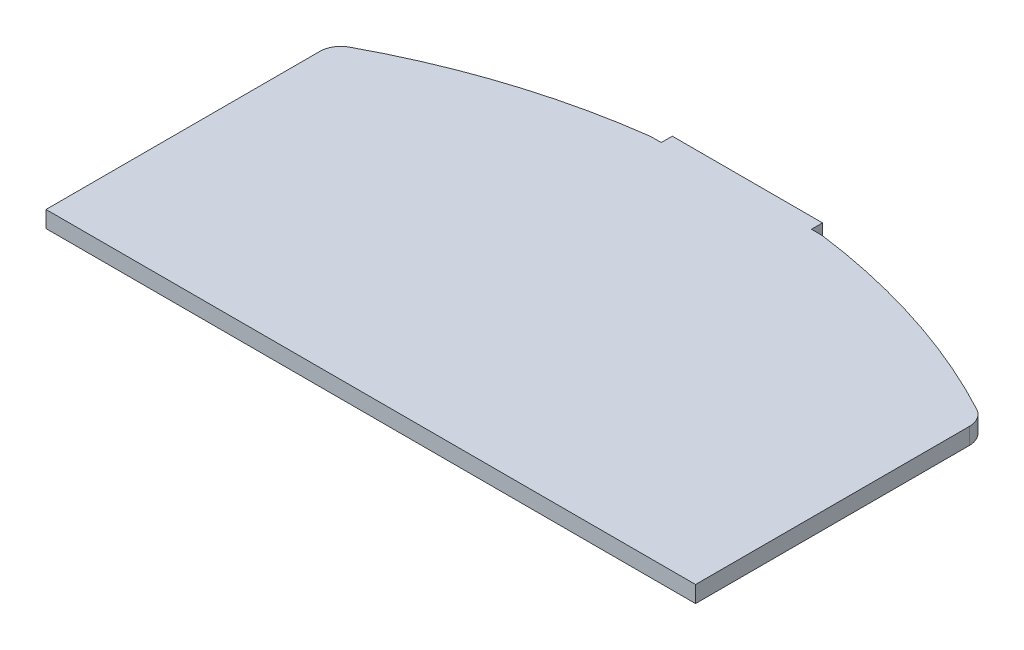
ISO-10303-21;
HEADER;
FILE_DESCRIPTION(('STEP AP214'),'2;1');
FILE_NAME('part.step','',(''),(''),'','','');
FILE_SCHEMA(('AUTOMOTIVE_DESIGN { 1 0 10303 214 1 1 1 1 }'));
ENDSEC;
DATA;
#1=APPLICATION_CONTEXT('core data for automotive mechanical design processes');
#2=APPLICATION_PROTOCOL_DEFINITION('international standard','automotive_design',2000,#1);
#3=PRODUCT_CONTEXT('',#1,'mechanical');
#4=PRODUCT('Part','Part','',(#3));
#5=PRODUCT_RELATED_PRODUCT_CATEGORY('part','',(#4));
#6=PRODUCT_DEFINITION_FORMATION('','',#4);
#7=PRODUCT_DEFINITION_CONTEXT('part definition',#1,'design');
#8=PRODUCT_DEFINITION('design','',#6,#7);
#9=PRODUCT_DEFINITION_SHAPE('','',#8);
#10=(LENGTH_UNIT() NAMED_UNIT(*) SI_UNIT(.MILLI.,.METRE.));
#11=(NAMED_UNIT(*) PLANE_ANGLE_UNIT() SI_UNIT($,.RADIAN.));
#12=(NAMED_UNIT(*) SI_UNIT($,.STERADIAN.) SOLID_ANGLE_UNIT());
#13=UNCERTAINTY_MEASURE_WITH_UNIT(LENGTH_MEASURE(1.E-05),#10,'distance_accuracy_value','');
#14=(GEOMETRIC_REPRESENTATION_CONTEXT(3) GLOBAL_UNCERTAINTY_ASSIGNED_CONTEXT((#13)) GLOBAL_UNIT_ASSIGNED_CONTEXT((#10,
#11,#12)) REPRESENTATION_CONTEXT('',''));
#15=CARTESIAN_POINT('',(0.,0.,0.));
#16=DIRECTION('',(0.,0.,1.));
#17=DIRECTION('',(1.,0.,0.));
#18=AXIS2_PLACEMENT_3D('',#15,#16,#17);
#19=CARTESIAN_POINT('',(29.3999563827221,1.5,35.6940425271087));
#20=DIRECTION('',(0.,0.,-1.));
#21=DIRECTION('',(-1.,0.,0.));
#22=AXIS2_PLACEMENT_3D('',#19,#20,#21);
#23=PLANE('',#22);
#24=DIRECTION('',(1.,0.,0.));
#25=VECTOR('',#24,1.);
#26=CARTESIAN_POINT('',(29.3999563827221,0.,35.6940425271087));
#27=LINE('',#26,#25);
#28=CARTESIAN_POINT('',(-29.3999563827227,0.,35.6940425271087));
#29=VERTEX_POINT('',#28);
#30=CARTESIAN_POINT('',(29.3999563827221,0.,35.6940425271087));
#31=VERTEX_POINT('',#30);
#32=EDGE_CURVE('E173',#29,#31,#27,.T.);
#33=ORIENTED_EDGE('',*,*,#32,.T.);
#34=DIRECTION('',(0.,-1.,0.));
#35=VECTOR('',#34,1.);
#36=CARTESIAN_POINT('',(29.3999563827221,1.5,35.6940425271087));
#37=LINE('',#36,#35);
#38=CARTESIAN_POINT('',(29.3999563827221,1.5,35.6940425271087));
#39=VERTEX_POINT('',#38);
#40=EDGE_CURVE('E11',#39,#31,#37,.T.);
#41=ORIENTED_EDGE('',*,*,#40,.F.);
#42=DIRECTION('',(1.,0.,0.));
#43=VECTOR('',#42,1.);
#44=CARTESIAN_POINT('',(29.3999563827221,1.5,35.6940425271087));
#45=LINE('',#44,#43);
#46=CARTESIAN_POINT('',(-29.3999563827227,1.5,35.6940425271087));
#47=VERTEX_POINT('',#46);
#48=EDGE_CURVE('E199',#47,#39,#45,.T.);
#49=ORIENTED_EDGE('',*,*,#48,.F.);
#50=DIRECTION('',(0.,-1.,0.));
#51=VECTOR('',#50,1.);
#52=CARTESIAN_POINT('',(-29.3999563827227,1.5,35.6940425271087));
#53=LINE('',#52,#51);
#54=EDGE_CURVE('E169',#47,#29,#53,.T.);
#55=ORIENTED_EDGE('',*,*,#54,.T.);
#56=EDGE_LOOP('',(#33,#41,#49,#55));
#57=FACE_BOUND('',#56,.T.);
#58=ADVANCED_FACE('F41',(#57),#23,.F.);
#59=CARTESIAN_POINT('',(29.3999563827221,1.5,10.9094402260191));
#60=DIRECTION('',(-1.,0.,0.));
#61=DIRECTION('',(0.,0.,1.));
#62=AXIS2_PLACEMENT_3D('',#59,#60,#61);
#63=PLANE('',#62);
#64=DIRECTION('',(0.,0.,-1.));
#65=VECTOR('',#64,1.);
#66=CARTESIAN_POINT('',(29.3999563827221,0.,10.9094402260191));
#67=LINE('',#66,#65);
#68=CARTESIAN_POINT('',(29.3999563827221,0.,10.9094402260191));
#69=VERTEX_POINT('',#68);
#70=EDGE_CURVE('E176',#31,#69,#67,.T.);
#71=ORIENTED_EDGE('',*,*,#70,.T.);
#72=DIRECTION('',(0.,-1.,0.));
#73=VECTOR('',#72,1.);
#74=CARTESIAN_POINT('',(29.3999563827221,1.5,10.9094402260191));
#75=LINE('',#74,#73);
#76=CARTESIAN_POINT('',(29.3999563827221,1.5,10.9094402260191));
#77=VERTEX_POINT('',#76);
#78=EDGE_CURVE('E49',#77,#69,#75,.T.);
#79=ORIENTED_EDGE('',*,*,#78,.F.);
#80=DIRECTION('',(0.,0.,-1.));
#81=VECTOR('',#80,1.);
#82=CARTESIAN_POINT('',(29.3999563827221,1.5,10.9094402260191));
#83=LINE('',#82,#81);
#84=EDGE_CURVE('E118',#39,#77,#83,.T.);
#85=ORIENTED_EDGE('',*,*,#84,.F.);
#86=ORIENTED_EDGE('',*,*,#40,.T.);
#87=EDGE_LOOP('',(#71,#79,#85,#86));
#88=FACE_BOUND('',#87,.T.);
#89=ADVANCED_FACE('F287',(#88),#63,.F.);
#90=CARTESIAN_POINT('',(27.4999563827228,1.5,10.9094402260147));
#91=DIRECTION('',(0.,-1.,0.));
#92=DIRECTION('',(0.,0.,-1.));
#93=AXIS2_PLACEMENT_3D('',#90,#91,#92);
#94=CYLINDRICAL_SURFACE('',#93,1.89999999999968);
#95=CARTESIAN_POINT('',(27.4999563827228,0.,10.9094402260147));
#96=DIRECTION('',(0.,1.,0.));
#97=DIRECTION('',(0.,0.,-1.));
#98=AXIS2_PLACEMENT_3D('',#95,#96,#97);
#99=CIRCLE('',#98,1.89999999999968);
#100=CARTESIAN_POINT('',(28.3980237538553,0.,9.23508214098456));
#101=VERTEX_POINT('',#100);
#102=EDGE_CURVE('E178',#69,#101,#99,.T.);
#103=ORIENTED_EDGE('',*,*,#102,.T.);
#104=DIRECTION('',(0.,-1.,0.));
#105=VECTOR('',#104,1.);
#106=CARTESIAN_POINT('',(28.3980237538553,1.5,9.23508214098456));
#107=LINE('',#106,#105);
#108=CARTESIAN_POINT('',(28.3980237538553,1.5,9.23508214098456));
#109=VERTEX_POINT('',#108);
#110=EDGE_CURVE('E224',#109,#101,#107,.T.);
#111=ORIENTED_EDGE('',*,*,#110,.F.);
#112=CARTESIAN_POINT('',(27.4999563827228,1.5,10.9094402260147));
#113=DIRECTION('',(0.,1.,0.));
#114=DIRECTION('',(0.,0.,-1.));
#115=AXIS2_PLACEMENT_3D('',#112,#113,#114);
#116=CIRCLE('',#115,1.89999999999968);
#117=EDGE_CURVE('E232',#77,#109,#116,.T.);
#118=ORIENTED_EDGE('',*,*,#117,.F.);
#119=ORIENTED_EDGE('',*,*,#78,.T.);
#120=EDGE_LOOP('',(#103,#111,#118,#119));
#121=FACE_BOUND('',#120,.T.);
#122=ADVANCED_FACE('F230',(#121),#94,.T.);
#123=CARTESIAN_POINT('',(0.,1.5,62.1803980488232));
#124=DIRECTION('',(0.,-1.,0.));
#125=DIRECTION('',(0.,0.,-1.));
#126=AXIS2_PLACEMENT_3D('',#123,#124,#125);
#127=CYLINDRICAL_SURFACE('',#126,60.0803980488251);
#128=CARTESIAN_POINT('',(0.,0.,62.1803980488232));
#129=DIRECTION('',(0.,1.,0.));
#130=DIRECTION('',(0.,0.,-1.));
#131=AXIS2_PLACEMENT_3D('',#128,#129,#130);
#132=CIRCLE('',#131,60.0803980488251);
#133=CARTESIAN_POINT('',(7.85976152908615,0.,2.61632852355344));
#134=VERTEX_POINT('',#133);
#135=EDGE_CURVE('E180',#101,#134,#132,.T.);
#136=ORIENTED_EDGE('',*,*,#135,.T.);
#137=DIRECTION('',(0.,-1.,0.));
#138=VECTOR('',#137,1.);
#139=CARTESIAN_POINT('',(7.85976152908615,1.5,2.61632852355344));
#140=LINE('',#139,#138);
#141=CARTESIAN_POINT('',(7.85976152908615,1.5,2.61632852355344));
#142=VERTEX_POINT('',#141);
#143=EDGE_CURVE('E221',#142,#134,#140,.T.);
#144=ORIENTED_EDGE('',*,*,#143,.F.);
#145=CARTESIAN_POINT('',(0.,1.5,62.1803980488232));
#146=DIRECTION('',(0.,1.,0.));
#147=DIRECTION('',(0.,0.,-1.));
#148=AXIS2_PLACEMENT_3D('',#145,#146,#147);
#149=CIRCLE('',#148,60.0803980488251);
#150=EDGE_CURVE('E250',#109,#142,#149,.T.);
#151=ORIENTED_EDGE('',*,*,#150,.F.);
#152=ORIENTED_EDGE('',*,*,#110,.T.);
#153=EDGE_LOOP('',(#136,#144,#151,#152));
#154=FACE_BOUND('',#153,.T.);
#155=ADVANCED_FACE('F241',(#154),#127,.T.);
#156=CARTESIAN_POINT('',(7.61120214216065,1.5,4.49999999999922));
#157=DIRECTION('',(0.,-1.,0.));
#158=DIRECTION('',(0.,0.,-1.));
#159=AXIS2_PLACEMENT_3D('',#156,#157,#158);
#160=CYLINDRICAL_SURFACE('',#159,1.9);
#161=CARTESIAN_POINT('',(7.61120214216065,0.,4.49999999999922));
#162=DIRECTION('',(0.,1.,0.));
#163=DIRECTION('',(0.,0.,-1.));
#164=AXIS2_PLACEMENT_3D('',#161,#162,#163);
#165=CIRCLE('',#164,1.9);
#166=CARTESIAN_POINT('',(7.61120214218058,0.,2.59999999999922));
#167=VERTEX_POINT('',#166);
#168=EDGE_CURVE('E182',#134,#167,#165,.T.);
#169=ORIENTED_EDGE('',*,*,#168,.T.);
#170=DIRECTION('',(0.,-1.,0.));
#171=VECTOR('',#170,1.);
#172=CARTESIAN_POINT('',(7.61120214218058,1.5,2.59999999999922));
#173=LINE('',#172,#171);
#174=CARTESIAN_POINT('',(7.61120214218058,1.5,2.59999999999922));
#175=VERTEX_POINT('',#174);
#176=EDGE_CURVE('E218',#175,#167,#173,.T.);
#177=ORIENTED_EDGE('',*,*,#176,.F.);
#178=CARTESIAN_POINT('',(7.61120214216065,1.5,4.49999999999922));
#179=DIRECTION('',(0.,1.,0.));
#180=DIRECTION('',(0.,0.,-1.));
#181=AXIS2_PLACEMENT_3D('',#178,#179,#180);
#182=CIRCLE('',#181,1.9);
#183=EDGE_CURVE('E247',#142,#175,#182,.T.);
#184=ORIENTED_EDGE('',*,*,#183,.F.);
#185=ORIENTED_EDGE('',*,*,#143,.T.);
#186=EDGE_LOOP('',(#169,#177,#184,#185));
#187=FACE_BOUND('',#186,.T.);
#188=ADVANCED_FACE('F245',(#187),#160,.T.);
#189=CARTESIAN_POINT('',(7.61120214218058,1.5,2.59999999999922));
#190=DIRECTION('',(-1.3878606544089E-12,0.,1.));
#191=DIRECTION('',(1.,0.,1.3878606544089E-12));
#192=AXIS2_PLACEMENT_3D('',#189,#190,#191);
#193=PLANE('',#192);
#194=DIRECTION('',(-1.,0.,-1.3878606544089E-12));
#195=VECTOR('',#194,1.);
#196=CARTESIAN_POINT('',(7.61120214218058,0.,2.59999999999922));
#197=LINE('',#196,#195);
#198=CARTESIAN_POINT('',(6.79999999999689,0.,2.5999999999981));
#199=VERTEX_POINT('',#198);
#200=EDGE_CURVE('E184',#167,#199,#197,.T.);
#201=ORIENTED_EDGE('',*,*,#200,.T.);
#202=DIRECTION('',(0.,-1.,0.));
#203=VECTOR('',#202,1.);
#204=CARTESIAN_POINT('',(6.79999999999689,1.5,2.5999999999981));
#205=LINE('',#204,#203);
#206=CARTESIAN_POINT('',(6.79999999999689,1.5,2.5999999999981));
#207=VERTEX_POINT('',#206);
#208=EDGE_CURVE('E215',#207,#199,#205,.T.);
#209=ORIENTED_EDGE('',*,*,#208,.F.);
#210=DIRECTION('',(-1.,0.,-1.3878606544089E-12));
#211=VECTOR('',#210,1.);
#212=CARTESIAN_POINT('',(7.61120214218058,1.5,2.59999999999922));
#213=LINE('',#212,#211);
#214=EDGE_CURVE('E249',#175,#207,#213,.T.);
#215=ORIENTED_EDGE('',*,*,#214,.F.);
#216=ORIENTED_EDGE('',*,*,#176,.T.);
#217=EDGE_LOOP('',(#201,#209,#215,#216));
#218=FACE_BOUND('',#217,.T.);
#219=ADVANCED_FACE('F300',(#218),#193,.F.);
#220=CARTESIAN_POINT('',(6.79999999999689,1.5,1.59999999999809));
#221=DIRECTION('',(-1.,0.,0.));
#222=DIRECTION('',(0.,0.,1.));
#223=AXIS2_PLACEMENT_3D('',#220,#221,#222);
#224=PLANE('',#223);
#225=DIRECTION('',(0.,0.,-1.));
#226=VECTOR('',#225,1.);
#227=CARTESIAN_POINT('',(6.79999999999689,0.,1.59999999999809));
#228=LINE('',#227,#226);
#229=CARTESIAN_POINT('',(6.79999999999689,0.,1.59999999999809));
#230=VERTEX_POINT('',#229);
#231=EDGE_CURVE('E186',#199,#230,#228,.T.);
#232=ORIENTED_EDGE('',*,*,#231,.T.);
#233=DIRECTION('',(0.,-1.,0.));
#234=VECTOR('',#233,1.);
#235=CARTESIAN_POINT('',(6.79999999999689,1.5,1.59999999999809));
#236=LINE('',#235,#234);
#237=CARTESIAN_POINT('',(6.79999999999689,1.5,1.59999999999809));
#238=VERTEX_POINT('',#237);
#239=EDGE_CURVE('E212',#238,#230,#236,.T.);
#240=ORIENTED_EDGE('',*,*,#239,.F.);
#241=DIRECTION('',(0.,0.,-1.));
#242=VECTOR('',#241,1.);
#243=CARTESIAN_POINT('',(6.79999999999689,1.5,1.59999999999809));
#244=LINE('',#243,#242);
#245=EDGE_CURVE('E252',#207,#238,#244,.T.);
#246=ORIENTED_EDGE('',*,*,#245,.F.);
#247=ORIENTED_EDGE('',*,*,#208,.T.);
#248=EDGE_LOOP('',(#232,#240,#246,#247));
#249=FACE_BOUND('',#248,.T.);
#250=ADVANCED_FACE('F303',(#249),#224,.F.);
#251=CARTESIAN_POINT('',(-6.79999999999689,1.5,1.59999999999809));
#252=DIRECTION('',(0.,0.,1.));
#253=DIRECTION('',(1.,0.,0.));
#254=AXIS2_PLACEMENT_3D('',#251,#252,#253);
#255=PLANE('',#254);
#256=DIRECTION('',(-1.,0.,0.));
#257=VECTOR('',#256,1.);
#258=CARTESIAN_POINT('',(-6.79999999999689,0.,1.59999999999809));
#259=LINE('',#258,#257);
#260=CARTESIAN_POINT('',(-6.79999999999689,0.,1.59999999999809));
#261=VERTEX_POINT('',#260);
#262=EDGE_CURVE('E188',#230,#261,#259,.T.);
#263=ORIENTED_EDGE('',*,*,#262,.T.);
#264=DIRECTION('',(0.,-1.,0.));
#265=VECTOR('',#264,1.);
#266=CARTESIAN_POINT('',(-6.79999999999689,1.5,1.59999999999809));
#267=LINE('',#266,#265);
#268=CARTESIAN_POINT('',(-6.79999999999689,1.5,1.59999999999809));
#269=VERTEX_POINT('',#268);
#270=EDGE_CURVE('E209',#269,#261,#267,.T.);
#271=ORIENTED_EDGE('',*,*,#270,.F.);
#272=DIRECTION('',(-1.,0.,0.));
#273=VECTOR('',#272,1.);
#274=CARTESIAN_POINT('',(-6.79999999999689,1.5,1.59999999999809));
#275=LINE('',#274,#273);
#276=EDGE_CURVE('E258',#238,#269,#275,.T.);
#277=ORIENTED_EDGE('',*,*,#276,.F.);
#278=ORIENTED_EDGE('',*,*,#239,.T.);
#279=EDGE_LOOP('',(#263,#271,#277,#278));
#280=FACE_BOUND('',#279,.T.);
#281=ADVANCED_FACE('F307',(#280),#255,.F.);
#282=CARTESIAN_POINT('',(-6.79999999999689,1.5,1.59999999999809));
#283=DIRECTION('',(1.,0.,0.));
#284=DIRECTION('',(0.,0.,-1.));
#285=AXIS2_PLACEMENT_3D('',#282,#283,#284);
#286=PLANE('',#285);
#287=DIRECTION('',(0.,0.,1.));
#288=VECTOR('',#287,1.);
#289=CARTESIAN_POINT('',(-6.79999999999689,0.,1.59999999999809));
#290=LINE('',#289,#288);
#291=CARTESIAN_POINT('',(-6.79999999999689,0.,2.5999999999981));
#292=VERTEX_POINT('',#291);
#293=EDGE_CURVE('E190',#261,#292,#290,.T.);
#294=ORIENTED_EDGE('',*,*,#293,.T.);
#295=DIRECTION('',(0.,-1.,0.));
#296=VECTOR('',#295,1.);
#297=CARTESIAN_POINT('',(-6.79999999999689,1.5,2.5999999999981));
#298=LINE('',#297,#296);
#299=CARTESIAN_POINT('',(-6.79999999999689,1.5,2.5999999999981));
#300=VERTEX_POINT('',#299);
#301=EDGE_CURVE('E206',#300,#292,#298,.T.);
#302=ORIENTED_EDGE('',*,*,#301,.F.);
#303=DIRECTION('',(0.,0.,1.));
#304=VECTOR('',#303,1.);
#305=CARTESIAN_POINT('',(-6.79999999999689,1.5,1.59999999999809));
#306=LINE('',#305,#304);
#307=EDGE_CURVE('E260',#269,#300,#306,.T.);
#308=ORIENTED_EDGE('',*,*,#307,.F.);
#309=ORIENTED_EDGE('',*,*,#270,.T.);
#310=EDGE_LOOP('',(#294,#302,#308,#309));
#311=FACE_BOUND('',#310,.T.);
#312=ADVANCED_FACE('F311',(#311),#286,.F.);
#313=CARTESIAN_POINT('',(-7.61120214218067,1.5,2.5999999999981));
#314=DIRECTION('',(0.,0.,1.));
#315=DIRECTION('',(1.,0.,0.));
#316=AXIS2_PLACEMENT_3D('',#313,#314,#315);
#317=PLANE('',#316);
#318=DIRECTION('',(-1.,0.,0.));
#319=VECTOR('',#318,1.);
#320=CARTESIAN_POINT('',(-7.61120214218067,0.,2.5999999999981));
#321=LINE('',#320,#319);
#322=CARTESIAN_POINT('',(-7.61120214218067,0.,2.5999999999981));
#323=VERTEX_POINT('',#322);
#324=EDGE_CURVE('E192',#292,#323,#321,.T.);
#325=ORIENTED_EDGE('',*,*,#324,.T.);
#326=DIRECTION('',(0.,-1.,0.));
#327=VECTOR('',#326,1.);
#328=CARTESIAN_POINT('',(-7.61120214218067,1.5,2.5999999999981));
#329=LINE('',#328,#327);
#330=CARTESIAN_POINT('',(-7.61120214218067,1.5,2.5999999999981));
#331=VERTEX_POINT('',#330);
#332=EDGE_CURVE('E203',#331,#323,#329,.T.);
#333=ORIENTED_EDGE('',*,*,#332,.F.);
#334=DIRECTION('',(-1.,0.,0.));
#335=VECTOR('',#334,1.);
#336=CARTESIAN_POINT('',(-7.61120214218067,1.5,2.5999999999981));
#337=LINE('',#336,#335);
#338=EDGE_CURVE('E262',#300,#331,#337,.T.);
#339=ORIENTED_EDGE('',*,*,#338,.F.);
#340=ORIENTED_EDGE('',*,*,#301,.T.);
#341=EDGE_LOOP('',(#325,#333,#339,#340));
#342=FACE_BOUND('',#341,.T.);
#343=ADVANCED_FACE('F268',(#342),#317,.F.);
#344=CARTESIAN_POINT('',(-7.61120214216055,1.5,4.4999999999981));
#345=DIRECTION('',(0.,-1.,0.));
#346=DIRECTION('',(0.,0.,-1.));
#347=AXIS2_PLACEMENT_3D('',#344,#345,#346);
#348=CYLINDRICAL_SURFACE('',#347,1.9);
#349=CARTESIAN_POINT('',(-7.61120214216055,0.,4.4999999999981));
#350=DIRECTION('',(0.,1.,0.));
#351=DIRECTION('',(0.,0.,1.));
#352=AXIS2_PLACEMENT_3D('',#349,#350,#351);
#353=CIRCLE('',#352,1.9);
#354=CARTESIAN_POINT('',(-7.8597615290861,0.,2.61632852355344));
#355=VERTEX_POINT('',#354);
#356=EDGE_CURVE('E194',#323,#355,#353,.T.);
#357=ORIENTED_EDGE('',*,*,#356,.T.);
#358=DIRECTION('',(0.,-1.,0.));
#359=VECTOR('',#358,1.);
#360=CARTESIAN_POINT('',(-7.8597615290861,1.5,2.61632852355344));
#361=LINE('',#360,#359);
#362=CARTESIAN_POINT('',(-7.8597615290861,1.5,2.61632852355344));
#363=VERTEX_POINT('',#362);
#364=EDGE_CURVE('E164',#363,#355,#361,.T.);
#365=ORIENTED_EDGE('',*,*,#364,.F.);
#366=CARTESIAN_POINT('',(-7.61120214216055,1.5,4.4999999999981));
#367=DIRECTION('',(0.,1.,0.));
#368=DIRECTION('',(0.,0.,1.));
#369=AXIS2_PLACEMENT_3D('',#366,#367,#368);
#370=CIRCLE('',#369,1.9);
#371=EDGE_CURVE('E155',#331,#363,#370,.T.);
#372=ORIENTED_EDGE('',*,*,#371,.F.);
#373=ORIENTED_EDGE('',*,*,#332,.T.);
#374=EDGE_LOOP('',(#357,#365,#372,#373));
#375=FACE_BOUND('',#374,.T.);
#376=ADVANCED_FACE('F272',(#375),#348,.T.);
#377=CARTESIAN_POINT('',(0.,1.5,62.1803980488232));
#378=DIRECTION('',(0.,-1.,0.));
#379=DIRECTION('',(0.,0.,-1.));
#380=AXIS2_PLACEMENT_3D('',#377,#378,#379);
#381=CYLINDRICAL_SURFACE('',#380,60.0803980488251);
#382=CARTESIAN_POINT('',(0.,0.,62.1803980488232));
#383=DIRECTION('',(0.,1.,0.));
#384=DIRECTION('',(0.,0.,1.));
#385=AXIS2_PLACEMENT_3D('',#382,#383,#384);
#386=CIRCLE('',#385,60.0803980488251);
#387=CARTESIAN_POINT('',(-28.3980237538555,0.,9.23508214098553));
#388=VERTEX_POINT('',#387);
#389=EDGE_CURVE('E163',#355,#388,#386,.T.);
#390=ORIENTED_EDGE('',*,*,#389,.T.);
#391=DIRECTION('',(0.,-1.,0.));
#392=VECTOR('',#391,1.);
#393=CARTESIAN_POINT('',(-28.3980237538555,1.5,9.23508214098553));
#394=LINE('',#393,#392);
#395=CARTESIAN_POINT('',(-28.3980237538555,1.5,9.23508214098553));
#396=VERTEX_POINT('',#395);
#397=EDGE_CURVE('E160',#396,#388,#394,.T.);
#398=ORIENTED_EDGE('',*,*,#397,.F.);
#399=CARTESIAN_POINT('',(0.,1.5,62.1803980488232));
#400=DIRECTION('',(0.,1.,0.));
#401=DIRECTION('',(0.,0.,1.));
#402=AXIS2_PLACEMENT_3D('',#399,#400,#401);
#403=CIRCLE('',#402,60.0803980488251);
#404=EDGE_CURVE('E149',#363,#396,#403,.T.);
#405=ORIENTED_EDGE('',*,*,#404,.F.);
#406=ORIENTED_EDGE('',*,*,#364,.T.);
#407=EDGE_LOOP('',(#390,#398,#405,#406));
#408=FACE_BOUND('',#407,.T.);
#409=ADVANCED_FACE('F161',(#408),#381,.T.);
#410=CARTESIAN_POINT('',(-27.4999563827227,1.5,10.9094402260159));
#411=DIRECTION('',(0.,-1.,0.));
#412=DIRECTION('',(0.,0.,-1.));
#413=AXIS2_PLACEMENT_3D('',#410,#411,#412);
#414=CYLINDRICAL_SURFACE('',#413,1.90000000000001);
#415=CARTESIAN_POINT('',(-27.4999563827227,0.,10.9094402260159));
#416=DIRECTION('',(0.,1.,0.));
#417=DIRECTION('',(0.,0.,1.));
#418=AXIS2_PLACEMENT_3D('',#415,#416,#417);
#419=CIRCLE('',#418,1.90000000000001);
#420=CARTESIAN_POINT('',(-29.3999563827227,0.,10.9094402260159));
#421=VERTEX_POINT('',#420);
#422=EDGE_CURVE('E104',#388,#421,#419,.T.);
#423=ORIENTED_EDGE('',*,*,#422,.T.);
#424=DIRECTION('',(0.,-1.,0.));
#425=VECTOR('',#424,1.);
#426=CARTESIAN_POINT('',(-29.3999563827227,1.5,10.9094402260159));
#427=LINE('',#426,#425);
#428=CARTESIAN_POINT('',(-29.3999563827227,1.5,10.9094402260159));
#429=VERTEX_POINT('',#428);
#430=EDGE_CURVE('E165',#429,#421,#427,.T.);
#431=ORIENTED_EDGE('',*,*,#430,.F.);
#432=CARTESIAN_POINT('',(-27.4999563827227,1.5,10.9094402260159));
#433=DIRECTION('',(0.,1.,0.));
#434=DIRECTION('',(0.,0.,1.));
#435=AXIS2_PLACEMENT_3D('',#432,#433,#434);
#436=CIRCLE('',#435,1.90000000000001);
#437=EDGE_CURVE('E153',#396,#429,#436,.T.);
#438=ORIENTED_EDGE('',*,*,#437,.F.);
#439=ORIENTED_EDGE('',*,*,#397,.T.);
#440=EDGE_LOOP('',(#423,#431,#438,#439));
#441=FACE_BOUND('',#440,.T.);
#442=ADVANCED_FACE('F167',(#441),#414,.T.);
#443=CARTESIAN_POINT('',(-29.3999563827227,1.5,10.9094402260159));
#444=DIRECTION('',(1.,0.,0.));
#445=DIRECTION('',(0.,0.,-1.));
#446=AXIS2_PLACEMENT_3D('',#443,#444,#445);
#447=PLANE('',#446);
#448=DIRECTION('',(0.,0.,1.));
#449=VECTOR('',#448,1.);
#450=CARTESIAN_POINT('',(-29.3999563827227,0.,10.9094402260159));
#451=LINE('',#450,#449);
#452=EDGE_CURVE('E110',#421,#29,#451,.T.);
#453=ORIENTED_EDGE('',*,*,#452,.T.);
#454=ORIENTED_EDGE('',*,*,#54,.F.);
#455=DIRECTION('',(0.,0.,1.));
#456=VECTOR('',#455,1.);
#457=CARTESIAN_POINT('',(-29.3999563827227,1.5,10.9094402260159));
#458=LINE('',#457,#456);
#459=EDGE_CURVE('E57',#429,#47,#458,.T.);
#460=ORIENTED_EDGE('',*,*,#459,.F.);
#461=ORIENTED_EDGE('',*,*,#430,.T.);
#462=EDGE_LOOP('',(#453,#454,#460,#461));
#463=FACE_BOUND('',#462,.T.);
#464=ADVANCED_FACE('F276',(#463),#447,.F.);
#465=CARTESIAN_POINT('',(-27.4999563827227,1.5,10.9094402260159));
#466=DIRECTION('',(0.,1.,0.));
#467=DIRECTION('',(0.,0.,1.));
#468=AXIS2_PLACEMENT_3D('',#465,#466,#467);
#469=PLANE('',#468);
#470=ORIENTED_EDGE('',*,*,#48,.T.);
#471=ORIENTED_EDGE('',*,*,#84,.T.);
#472=ORIENTED_EDGE('',*,*,#117,.T.);
#473=ORIENTED_EDGE('',*,*,#150,.T.);
#474=ORIENTED_EDGE('',*,*,#183,.T.);
#475=ORIENTED_EDGE('',*,*,#214,.T.);
#476=ORIENTED_EDGE('',*,*,#245,.T.);
#477=ORIENTED_EDGE('',*,*,#276,.T.);
#478=ORIENTED_EDGE('',*,*,#307,.T.);
#479=ORIENTED_EDGE('',*,*,#338,.T.);
#480=ORIENTED_EDGE('',*,*,#371,.T.);
#481=ORIENTED_EDGE('',*,*,#404,.T.);
#482=ORIENTED_EDGE('',*,*,#437,.T.);
#483=ORIENTED_EDGE('',*,*,#459,.T.);
#484=EDGE_LOOP('',(#470,#471,#472,#473,#474,#475,#476,#477,#478,#479,#480,#481,#482,#483));
#485=FACE_BOUND('',#484,.T.);
#486=ADVANCED_FACE('F151',(#485),#469,.T.);
#487=CARTESIAN_POINT('',(-27.4999563827227,0.,10.9094402260159));
#488=DIRECTION('',(0.,1.,0.));
#489=DIRECTION('',(0.,0.,1.));
#490=AXIS2_PLACEMENT_3D('',#487,#488,#489);
#491=PLANE('',#490);
#492=ORIENTED_EDGE('',*,*,#32,.F.);
#493=ORIENTED_EDGE('',*,*,#452,.F.);
#494=ORIENTED_EDGE('',*,*,#422,.F.);
#495=ORIENTED_EDGE('',*,*,#389,.F.);
#496=ORIENTED_EDGE('',*,*,#356,.F.);
#497=ORIENTED_EDGE('',*,*,#324,.F.);
#498=ORIENTED_EDGE('',*,*,#293,.F.);
#499=ORIENTED_EDGE('',*,*,#262,.F.);
#500=ORIENTED_EDGE('',*,*,#231,.F.);
#501=ORIENTED_EDGE('',*,*,#200,.F.);
#502=ORIENTED_EDGE('',*,*,#168,.F.);
#503=ORIENTED_EDGE('',*,*,#135,.F.);
#504=ORIENTED_EDGE('',*,*,#102,.F.);
#505=ORIENTED_EDGE('',*,*,#70,.F.);
#506=EDGE_LOOP('',(#492,#493,#494,#495,#496,#497,#498,#499,#500,#501,#502,#503,#504,#505));
#507=FACE_BOUND('',#506,.T.);
#508=ADVANCED_FACE('F236',(#507),#491,.F.);
#509=CLOSED_SHELL('',(#58,#89,#122,#155,#188,#219,#250,#281,#312,#343,#376,#409,#442,#464,#486,#508));
#510=MANIFOLD_SOLID_BREP('B2',#509);
#511=ADVANCED_BREP_SHAPE_REPRESENTATION('',(#18,#510),#14);
#512=SHAPE_DEFINITION_REPRESENTATION(#9,#511);
ENDSEC;
END-ISO-10303-21;
